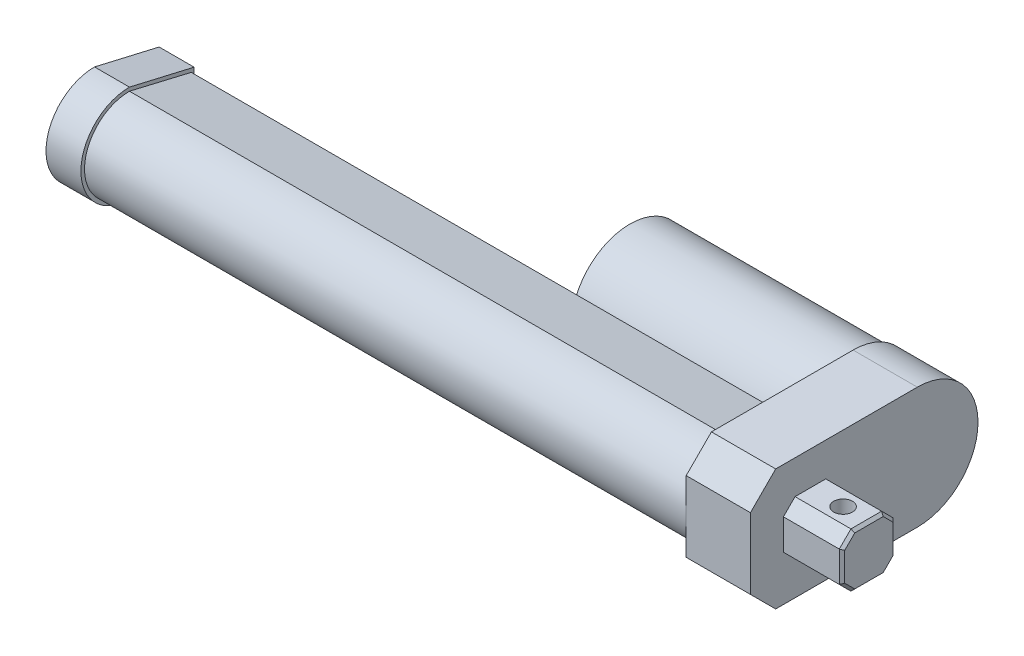
ISO-10303-21;
HEADER;
FILE_DESCRIPTION(('STEP AP214'),'2;1');
FILE_NAME('part.step','',(''),(''),'','','');
FILE_SCHEMA(('AUTOMOTIVE_DESIGN { 1 0 10303 214 1 1 1 1 }'));
ENDSEC;
DATA;
#1=APPLICATION_CONTEXT('core data for automotive mechanical design processes');
#2=APPLICATION_PROTOCOL_DEFINITION('international standard','automotive_design',2000,#1);
#3=PRODUCT_CONTEXT('',#1,'mechanical');
#4=PRODUCT('Part','Part','',(#3));
#5=PRODUCT_RELATED_PRODUCT_CATEGORY('part','',(#4));
#6=PRODUCT_DEFINITION_FORMATION('','',#4);
#7=PRODUCT_DEFINITION_CONTEXT('part definition',#1,'design');
#8=PRODUCT_DEFINITION('design','',#6,#7);
#9=PRODUCT_DEFINITION_SHAPE('','',#8);
#10=(LENGTH_UNIT() NAMED_UNIT(*) SI_UNIT(.MILLI.,.METRE.));
#11=(NAMED_UNIT(*) PLANE_ANGLE_UNIT() SI_UNIT($,.RADIAN.));
#12=(NAMED_UNIT(*) SI_UNIT($,.STERADIAN.) SOLID_ANGLE_UNIT());
#13=UNCERTAINTY_MEASURE_WITH_UNIT(LENGTH_MEASURE(1.E-05),#10,'distance_accuracy_value','');
#14=(GEOMETRIC_REPRESENTATION_CONTEXT(3) GLOBAL_UNCERTAINTY_ASSIGNED_CONTEXT((#13)) GLOBAL_UNIT_ASSIGNED_CONTEXT((#10,
#11,#12)) REPRESENTATION_CONTEXT('',''));
#15=CARTESIAN_POINT('',(0.,0.,0.));
#16=DIRECTION('',(0.,0.,1.));
#17=DIRECTION('',(1.,0.,0.));
#18=AXIS2_PLACEMENT_3D('',#15,#16,#17);
#19=CARTESIAN_POINT('',(0.,0.,0.));
#20=DIRECTION('',(1.,0.,0.));
#21=DIRECTION('',(0.,0.,-1.));
#22=AXIS2_PLACEMENT_3D('',#19,#20,#21);
#23=PLANE('',#22);
#24=CARTESIAN_POINT('',(0.,19.84375,-54.61));
#25=DIRECTION('',(1.,0.,0.));
#26=DIRECTION('',(0.,0.,-1.));
#27=AXIS2_PLACEMENT_3D('',#24,#25,#26);
#28=CIRCLE('',#27,19.05);
#29=CARTESIAN_POINT('',(0.,19.84375,-73.66));
#30=VERTEX_POINT('',#29);
#31=EDGE_CURVE('E309',#30,#30,#28,.F.);
#32=ORIENTED_EDGE('',*,*,#31,.F.);
#33=EDGE_LOOP('',(#32));
#34=FACE_BOUND('',#33,.T.);
#35=DIRECTION('',(0.,-0.229567479099,0.973292747604815));
#36=VECTOR('',#35,1.);
#37=CARTESIAN_POINT('',(0.,1.58042668071531,0.372770237819472));
#38=LINE('',#37,#36);
#39=CARTESIAN_POINT('',(0.,9.906,-34.925));
#40=VERTEX_POINT('',#39);
#41=CARTESIAN_POINT('',(0.,5.13714999999999,-14.7066));
#42=VERTEX_POINT('',#41);
#43=EDGE_CURVE('E250',#40,#42,#38,.T.);
#44=ORIENTED_EDGE('',*,*,#43,.F.);
#45=DIRECTION('',(0.,1.,0.));
#46=VECTOR('',#45,1.);
#47=CARTESIAN_POINT('',(0.,0.,-34.925));
#48=LINE('',#47,#46);
#49=CARTESIAN_POINT('',(0.,29.7815,-34.925));
#50=VERTEX_POINT('',#49);
#51=EDGE_CURVE('E265',#40,#50,#48,.T.);
#52=ORIENTED_EDGE('',*,*,#51,.T.);
#53=DIRECTION('',(0.,0.229567479099,0.973292747604815));
#54=VECTOR('',#53,1.);
#55=CARTESIAN_POINT('',(0.,36.0154933544711,-8.49486039862054));
#56=LINE('',#55,#54);
#57=CARTESIAN_POINT('',(0.,34.55035,-14.7066));
#58=VERTEX_POINT('',#57);
#59=EDGE_CURVE('E279',#50,#58,#56,.T.);
#60=ORIENTED_EDGE('',*,*,#59,.T.);
#61=CARTESIAN_POINT('',(0.,19.84375,-14.7066));
#62=DIRECTION('',(1.,0.,0.));
#63=DIRECTION('',(0.,0.,-1.));
#64=AXIS2_PLACEMENT_3D('',#61,#62,#63);
#65=CIRCLE('',#64,14.7066);
#66=CARTESIAN_POINT('',(0.,19.84375,0.));
#67=VERTEX_POINT('',#66);
#68=EDGE_CURVE('E308',#67,#58,#65,.F.);
#69=ORIENTED_EDGE('',*,*,#68,.F.);
#70=DIRECTION('',(0.,1.,0.));
#71=VECTOR('',#70,1.);
#72=CARTESIAN_POINT('',(0.,0.,0.));
#73=LINE('',#72,#71);
#74=CARTESIAN_POINT('',(0.,31.4256643774,0.));
#75=VERTEX_POINT('',#74);
#76=EDGE_CURVE('E339',#67,#75,#73,.T.);
#77=ORIENTED_EDGE('',*,*,#76,.T.);
#78=DIRECTION('',(0.,-0.707106781186548,0.707106781186547));
#79=VECTOR('',#78,1.);
#80=CARTESIAN_POINT('',(0.,31.4256643774,0.));
#81=LINE('',#80,#79);
#82=CARTESIAN_POINT('',(0.,39.6875,-8.26183562260002));
#83=VERTEX_POINT('',#82);
#84=EDGE_CURVE('E354',#75,#83,#81,.F.);
#85=ORIENTED_EDGE('',*,*,#84,.T.);
#86=DIRECTION('',(0.,0.,-1.));
#87=VECTOR('',#86,1.);
#88=CARTESIAN_POINT('',(0.,39.6875,0.));
#89=LINE('',#88,#87);
#90=CARTESIAN_POINT('',(0.,39.6875,-54.61));
#91=VERTEX_POINT('',#90);
#92=EDGE_CURVE('E336',#83,#91,#89,.T.);
#93=ORIENTED_EDGE('',*,*,#92,.T.);
#94=CARTESIAN_POINT('',(0.,19.84375,-54.61));
#95=DIRECTION('',(1.,0.,0.));
#96=DIRECTION('',(0.,0.,-1.));
#97=AXIS2_PLACEMENT_3D('',#94,#95,#96);
#98=CIRCLE('',#97,19.84375);
#99=CARTESIAN_POINT('',(0.,0.,-54.61));
#100=VERTEX_POINT('',#99);
#101=EDGE_CURVE('E332',#91,#100,#98,.F.);
#102=ORIENTED_EDGE('',*,*,#101,.T.);
#103=DIRECTION('',(0.,0.,-1.));
#104=VECTOR('',#103,1.);
#105=CARTESIAN_POINT('',(0.,0.,0.));
#106=LINE('',#105,#104);
#107=CARTESIAN_POINT('',(0.,0.,-8.26183562260002));
#108=VERTEX_POINT('',#107);
#109=EDGE_CURVE('E313',#108,#100,#106,.T.);
#110=ORIENTED_EDGE('',*,*,#109,.F.);
#111=DIRECTION('',(0.,0.707106781186548,0.707106781186548));
#112=VECTOR('',#111,1.);
#113=CARTESIAN_POINT('',(0.,0.,-8.26183562260002));
#114=LINE('',#113,#112);
#115=CARTESIAN_POINT('',(0.,8.26183562260002,0.));
#116=VERTEX_POINT('',#115);
#117=EDGE_CURVE('E357',#108,#116,#114,.T.);
#118=ORIENTED_EDGE('',*,*,#117,.T.);
#119=EDGE_CURVE('E318',#116,#67,#73,.T.);
#120=ORIENTED_EDGE('',*,*,#119,.T.);
#121=CARTESIAN_POINT('',(0.,19.84375,-14.7066));
#122=DIRECTION('',(-1.,0.,0.));
#123=DIRECTION('',(0.,0.,1.));
#124=AXIS2_PLACEMENT_3D('',#121,#122,#123);
#125=CIRCLE('',#124,14.7066);
#126=EDGE_CURVE('E255',#42,#67,#125,.T.);
#127=ORIENTED_EDGE('',*,*,#126,.F.);
#128=EDGE_LOOP('',(#44,#52,#60,#69,#77,#85,#93,#102,#110,#118,#120,#127));
#129=FACE_BOUND('',#128,.T.);
#130=ADVANCED_FACE('F42',(#34,#129),#23,.F.);
#131=CARTESIAN_POINT('',(21.0185,0.,0.));
#132=DIRECTION('',(0.,1.,0.));
#133=DIRECTION('',(0.,0.,1.));
#134=AXIS2_PLACEMENT_3D('',#131,#132,#133);
#135=PLANE('',#134);
#136=DIRECTION('',(0.,0.,-1.));
#137=VECTOR('',#136,1.);
#138=CARTESIAN_POINT('',(21.0185,0.,0.));
#139=LINE('',#138,#137);
#140=CARTESIAN_POINT('',(21.0185,0.,-8.26183562260002));
#141=VERTEX_POINT('',#140);
#142=CARTESIAN_POINT('',(21.0185,0.,-54.61));
#143=VERTEX_POINT('',#142);
#144=EDGE_CURVE('E314',#141,#143,#139,.T.);
#145=ORIENTED_EDGE('',*,*,#144,.F.);
#146=DIRECTION('',(-1.,0.,0.));
#147=VECTOR('',#146,1.);
#148=CARTESIAN_POINT('',(0.,0.,-8.26183562260002));
#149=LINE('',#148,#147);
#150=EDGE_CURVE('E350',#141,#108,#149,.T.);
#151=ORIENTED_EDGE('',*,*,#150,.T.);
#152=ORIENTED_EDGE('',*,*,#109,.T.);
#153=DIRECTION('',(-1.,0.,0.));
#154=VECTOR('',#153,1.);
#155=CARTESIAN_POINT('',(21.0185,0.,-54.61));
#156=LINE('',#155,#154);
#157=EDGE_CURVE('E346',#143,#100,#156,.T.);
#158=ORIENTED_EDGE('',*,*,#157,.F.);
#159=EDGE_LOOP('',(#145,#151,#152,#158));
#160=FACE_BOUND('',#159,.T.);
#161=ADVANCED_FACE('F568',(#160),#135,.F.);
#162=CARTESIAN_POINT('',(21.0185,19.84375,-54.61));
#163=DIRECTION('',(-1.,0.,0.));
#164=DIRECTION('',(0.,0.,1.));
#165=AXIS2_PLACEMENT_3D('',#162,#163,#164);
#166=CYLINDRICAL_SURFACE('',#165,19.84375);
#167=ORIENTED_EDGE('',*,*,#101,.F.);
#168=DIRECTION('',(-1.,0.,0.));
#169=VECTOR('',#168,1.);
#170=CARTESIAN_POINT('',(21.0185,39.6875,-54.61));
#171=LINE('',#170,#169);
#172=CARTESIAN_POINT('',(21.0185,39.6875,-54.61));
#173=VERTEX_POINT('',#172);
#174=EDGE_CURVE('E329',#173,#91,#171,.T.);
#175=ORIENTED_EDGE('',*,*,#174,.F.);
#176=CARTESIAN_POINT('',(21.0185,19.84375,-54.61));
#177=DIRECTION('',(1.,0.,0.));
#178=DIRECTION('',(0.,0.,-1.));
#179=AXIS2_PLACEMENT_3D('',#176,#177,#178);
#180=CIRCLE('',#179,19.84375);
#181=EDGE_CURVE('E317',#173,#143,#180,.F.);
#182=ORIENTED_EDGE('',*,*,#181,.T.);
#183=ORIENTED_EDGE('',*,*,#157,.T.);
#184=EDGE_LOOP('',(#167,#175,#182,#183));
#185=FACE_BOUND('',#184,.T.);
#186=ADVANCED_FACE('F574',(#185),#166,.T.);
#187=CARTESIAN_POINT('',(21.0185,39.6875,0.));
#188=DIRECTION('',(0.,1.,0.));
#189=DIRECTION('',(0.,0.,1.));
#190=AXIS2_PLACEMENT_3D('',#187,#188,#189);
#191=PLANE('',#190);
#192=ORIENTED_EDGE('',*,*,#92,.F.);
#193=DIRECTION('',(1.,0.,0.));
#194=VECTOR('',#193,1.);
#195=CARTESIAN_POINT('',(21.0185,39.6875,-8.26183562260002));
#196=LINE('',#195,#194);
#197=CARTESIAN_POINT('',(21.0185,39.6875,-8.26183562260002));
#198=VERTEX_POINT('',#197);
#199=EDGE_CURVE('E373',#83,#198,#196,.T.);
#200=ORIENTED_EDGE('',*,*,#199,.T.);
#201=DIRECTION('',(0.,0.,-1.));
#202=VECTOR('',#201,1.);
#203=CARTESIAN_POINT('',(21.0185,39.6875,0.));
#204=LINE('',#203,#202);
#205=EDGE_CURVE('E322',#198,#173,#204,.T.);
#206=ORIENTED_EDGE('',*,*,#205,.T.);
#207=ORIENTED_EDGE('',*,*,#174,.T.);
#208=EDGE_LOOP('',(#192,#200,#206,#207));
#209=FACE_BOUND('',#208,.T.);
#210=ADVANCED_FACE('F586',(#209),#191,.T.);
#211=CARTESIAN_POINT('',(21.0185,0.,0.));
#212=DIRECTION('',(0.,0.,1.));
#213=DIRECTION('',(1.,0.,0.));
#214=AXIS2_PLACEMENT_3D('',#211,#212,#213);
#215=PLANE('',#214);
#216=ORIENTED_EDGE('',*,*,#119,.F.);
#217=DIRECTION('',(1.,0.,0.));
#218=VECTOR('',#217,1.);
#219=CARTESIAN_POINT('',(21.0185,8.26183562260002,0.));
#220=LINE('',#219,#218);
#221=CARTESIAN_POINT('',(21.0185,8.26183562260002,0.));
#222=VERTEX_POINT('',#221);
#223=EDGE_CURVE('E364',#116,#222,#220,.T.);
#224=ORIENTED_EDGE('',*,*,#223,.T.);
#225=DIRECTION('',(0.,1.,0.));
#226=VECTOR('',#225,1.);
#227=CARTESIAN_POINT('',(21.0185,0.,0.));
#228=LINE('',#227,#226);
#229=CARTESIAN_POINT('',(21.0185,31.4256643774,0.));
#230=VERTEX_POINT('',#229);
#231=EDGE_CURVE('E325',#222,#230,#228,.T.);
#232=ORIENTED_EDGE('',*,*,#231,.T.);
#233=DIRECTION('',(-1.,0.,0.));
#234=VECTOR('',#233,1.);
#235=CARTESIAN_POINT('',(21.0185,31.4256643774,0.));
#236=LINE('',#235,#234);
#237=EDGE_CURVE('E360',#230,#75,#236,.T.);
#238=ORIENTED_EDGE('',*,*,#237,.T.);
#239=ORIENTED_EDGE('',*,*,#76,.F.);
#240=EDGE_LOOP('',(#216,#224,#232,#238,#239));
#241=FACE_BOUND('',#240,.T.);
#242=ADVANCED_FACE('F583',(#241),#215,.T.);
#243=CARTESIAN_POINT('',(21.0185,0.,0.));
#244=DIRECTION('',(1.,0.,0.));
#245=DIRECTION('',(0.,0.,-1.));
#246=AXIS2_PLACEMENT_3D('',#243,#244,#245);
#247=PLANE('',#246);
#248=DIRECTION('',(0.,1.,0.));
#249=VECTOR('',#248,1.);
#250=CARTESIAN_POINT('',(21.0185,0.,-28.4480000000004));
#251=LINE('',#250,#249);
#252=CARTESIAN_POINT('',(21.0185,14.82725,-28.4480000000004));
#253=VERTEX_POINT('',#252);
#254=CARTESIAN_POINT('',(21.0185,24.8602499999999,-28.4480000000004));
#255=VERTEX_POINT('',#254);
#256=EDGE_CURVE('E512',#253,#255,#251,.T.);
#257=ORIENTED_EDGE('',*,*,#256,.F.);
#258=DIRECTION('',(0.,-0.707106781186545,0.70710678118655));
#259=VECTOR('',#258,1.);
#260=CARTESIAN_POINT('',(21.0185,14.82725,-28.4480000000004));
#261=LINE('',#260,#259);
#262=CARTESIAN_POINT('',(21.0185,11.01725,-24.6380000000004));
#263=VERTEX_POINT('',#262);
#264=EDGE_CURVE('E413',#253,#263,#261,.T.);
#265=ORIENTED_EDGE('',*,*,#264,.T.);
#266=DIRECTION('',(0.,0.,1.));
#267=VECTOR('',#266,1.);
#268=CARTESIAN_POINT('',(21.0185,11.01725,0.));
#269=LINE('',#268,#267);
#270=CARTESIAN_POINT('',(21.0185,11.01725,-14.605));
#271=VERTEX_POINT('',#270);
#272=EDGE_CURVE('E506',#263,#271,#269,.T.);
#273=ORIENTED_EDGE('',*,*,#272,.T.);
#274=DIRECTION('',(0.,0.707106781186548,0.707106781186548));
#275=VECTOR('',#274,1.);
#276=CARTESIAN_POINT('',(21.0185,11.01725,-14.605));
#277=LINE('',#276,#275);
#278=CARTESIAN_POINT('',(21.0185,14.82725,-10.795));
#279=VERTEX_POINT('',#278);
#280=EDGE_CURVE('E416',#271,#279,#277,.T.);
#281=ORIENTED_EDGE('',*,*,#280,.T.);
#282=DIRECTION('',(0.,-1.,0.));
#283=VECTOR('',#282,1.);
#284=CARTESIAN_POINT('',(21.0185,0.,-10.795));
#285=LINE('',#284,#283);
#286=CARTESIAN_POINT('',(21.0185,24.86025,-10.795));
#287=VERTEX_POINT('',#286);
#288=EDGE_CURVE('E520',#287,#279,#285,.T.);
#289=ORIENTED_EDGE('',*,*,#288,.F.);
#290=DIRECTION('',(0.,-0.707106781186548,0.707106781186548));
#291=VECTOR('',#290,1.);
#292=CARTESIAN_POINT('',(21.0185,24.86025,-10.795));
#293=LINE('',#292,#291);
#294=CARTESIAN_POINT('',(21.0185,28.67025,-14.605));
#295=VERTEX_POINT('',#294);
#296=EDGE_CURVE('E407',#287,#295,#293,.F.);
#297=ORIENTED_EDGE('',*,*,#296,.T.);
#298=DIRECTION('',(0.,0.,1.));
#299=VECTOR('',#298,1.);
#300=CARTESIAN_POINT('',(21.0185,28.67025,0.));
#301=LINE('',#300,#299);
#302=CARTESIAN_POINT('',(21.0185,28.67025,-24.6380000000004));
#303=VERTEX_POINT('',#302);
#304=EDGE_CURVE('E516',#303,#295,#301,.T.);
#305=ORIENTED_EDGE('',*,*,#304,.F.);
#306=DIRECTION('',(0.,0.707106781186548,0.707106781186548));
#307=VECTOR('',#306,1.);
#308=CARTESIAN_POINT('',(21.0185,28.67025,-24.6380000000004));
#309=LINE('',#308,#307);
#310=EDGE_CURVE('E410',#303,#255,#309,.F.);
#311=ORIENTED_EDGE('',*,*,#310,.T.);
#312=EDGE_LOOP('',(#257,#265,#273,#281,#289,#297,#305,#311));
#313=FACE_BOUND('',#312,.T.);
#314=ORIENTED_EDGE('',*,*,#231,.F.);
#315=DIRECTION('',(0.,-0.707106781186548,-0.707106781186548));
#316=VECTOR('',#315,1.);
#317=CARTESIAN_POINT('',(21.0185,4.13091781130001,-4.13091781130001));
#318=LINE('',#317,#316);
#319=EDGE_CURVE('E370',#222,#141,#318,.T.);
#320=ORIENTED_EDGE('',*,*,#319,.T.);
#321=ORIENTED_EDGE('',*,*,#144,.T.);
#322=ORIENTED_EDGE('',*,*,#181,.F.);
#323=ORIENTED_EDGE('',*,*,#205,.F.);
#324=DIRECTION('',(0.,0.707106781186548,-0.707106781186547));
#325=VECTOR('',#324,1.);
#326=CARTESIAN_POINT('',(21.0185,15.7128321887,15.7128321887));
#327=LINE('',#326,#325);
#328=EDGE_CURVE('E367',#198,#230,#327,.F.);
#329=ORIENTED_EDGE('',*,*,#328,.T.);
#330=EDGE_LOOP('',(#314,#320,#321,#322,#323,#329));
#331=FACE_BOUND('',#330,.T.);
#332=ADVANCED_FACE('F581',(#313,#331),#247,.T.);
#333=CARTESIAN_POINT('',(21.0185,0.,-8.26183562260002));
#334=DIRECTION('',(0.,-0.707106781186547,0.707106781186547));
#335=DIRECTION('',(1.,0.,0.));
#336=AXIS2_PLACEMENT_3D('',#333,#334,#335);
#337=PLANE('',#336);
#338=ORIENTED_EDGE('',*,*,#319,.F.);
#339=ORIENTED_EDGE('',*,*,#223,.F.);
#340=ORIENTED_EDGE('',*,*,#117,.F.);
#341=ORIENTED_EDGE('',*,*,#150,.F.);
#342=EDGE_LOOP('',(#338,#339,#340,#341));
#343=FACE_BOUND('',#342,.T.);
#344=ADVANCED_FACE('F594',(#343),#337,.T.);
#345=CARTESIAN_POINT('',(21.0185,31.4256643774,0.));
#346=DIRECTION('',(0.,-0.707106781186547,-0.707106781186548));
#347=DIRECTION('',(-1.,0.,0.));
#348=AXIS2_PLACEMENT_3D('',#345,#346,#347);
#349=PLANE('',#348);
#350=ORIENTED_EDGE('',*,*,#328,.F.);
#351=ORIENTED_EDGE('',*,*,#199,.F.);
#352=ORIENTED_EDGE('',*,*,#84,.F.);
#353=ORIENTED_EDGE('',*,*,#237,.F.);
#354=EDGE_LOOP('',(#350,#351,#352,#353));
#355=FACE_BOUND('',#354,.T.);
#356=ADVANCED_FACE('F597',(#355),#349,.F.);
#357=CARTESIAN_POINT('',(-73.025,19.84375,-54.61));
#358=DIRECTION('',(1.,0.,0.));
#359=DIRECTION('',(0.,0.,-1.));
#360=AXIS2_PLACEMENT_3D('',#357,#358,#359);
#361=CYLINDRICAL_SURFACE('',#360,19.05);
#362=CARTESIAN_POINT('',(-73.025,19.84375,-54.61));
#363=DIRECTION('',(-1.,0.,0.));
#364=DIRECTION('',(0.,0.,1.));
#365=AXIS2_PLACEMENT_3D('',#362,#363,#364);
#366=CIRCLE('',#365,19.05);
#367=CARTESIAN_POINT('',(-73.025,19.84375,-35.56));
#368=VERTEX_POINT('',#367);
#369=EDGE_CURVE('E303',#368,#368,#366,.T.);
#370=ORIENTED_EDGE('',*,*,#369,.F.);
#371=EDGE_LOOP('',(#370));
#372=FACE_BOUND('',#371,.T.);
#373=ORIENTED_EDGE('',*,*,#31,.T.);
#374=EDGE_LOOP('',(#373));
#375=FACE_BOUND('',#374,.T.);
#376=ADVANCED_FACE('F601',(#372,#375),#361,.T.);
#377=CARTESIAN_POINT('',(-73.025,19.84375,-54.61));
#378=DIRECTION('',(-1.,0.,0.));
#379=DIRECTION('',(0.,0.,1.));
#380=AXIS2_PLACEMENT_3D('',#377,#378,#379);
#381=PLANE('',#380);
#382=CARTESIAN_POINT('',(-73.025,19.84375,-54.61));
#383=DIRECTION('',(-1.,0.,0.));
#384=DIRECTION('',(0.,0.,1.));
#385=AXIS2_PLACEMENT_3D('',#382,#383,#384);
#386=CIRCLE('',#385,6.35);
#387=CARTESIAN_POINT('',(-73.025,19.84375,-48.26));
#388=VERTEX_POINT('',#387);
#389=EDGE_CURVE('E304',#388,#388,#386,.T.);
#390=ORIENTED_EDGE('',*,*,#389,.F.);
#391=EDGE_LOOP('',(#390));
#392=FACE_BOUND('',#391,.T.);
#393=ORIENTED_EDGE('',*,*,#369,.T.);
#394=EDGE_LOOP('',(#393));
#395=FACE_BOUND('',#394,.T.);
#396=ADVANCED_FACE('F748',(#392,#395),#381,.T.);
#397=CARTESIAN_POINT('',(-75.565,19.84375,-54.61));
#398=DIRECTION('',(1.,0.,0.));
#399=DIRECTION('',(0.,0.,-1.));
#400=AXIS2_PLACEMENT_3D('',#397,#398,#399);
#401=CYLINDRICAL_SURFACE('',#400,6.35);
#402=CARTESIAN_POINT('',(-75.565,19.84375,-54.61));
#403=DIRECTION('',(-1.,0.,0.));
#404=DIRECTION('',(0.,0.,1.));
#405=AXIS2_PLACEMENT_3D('',#402,#403,#404);
#406=CIRCLE('',#405,6.35);
#407=CARTESIAN_POINT('',(-75.565,19.84375,-48.26));
#408=VERTEX_POINT('',#407);
#409=EDGE_CURVE('E299',#408,#408,#406,.T.);
#410=ORIENTED_EDGE('',*,*,#409,.F.);
#411=EDGE_LOOP('',(#410));
#412=FACE_BOUND('',#411,.T.);
#413=ORIENTED_EDGE('',*,*,#389,.T.);
#414=EDGE_LOOP('',(#413));
#415=FACE_BOUND('',#414,.T.);
#416=ADVANCED_FACE('F744',(#412,#415),#401,.T.);
#417=CARTESIAN_POINT('',(-75.565,19.84375,-54.61));
#418=DIRECTION('',(-1.,0.,0.));
#419=DIRECTION('',(0.,0.,1.));
#420=AXIS2_PLACEMENT_3D('',#417,#418,#419);
#421=PLANE('',#420);
#422=ORIENTED_EDGE('',*,*,#409,.T.);
#423=EDGE_LOOP('',(#422));
#424=FACE_BOUND('',#423,.T.);
#425=ADVANCED_FACE('F740',(#424),#421,.T.);
#426=CARTESIAN_POINT('',(-196.85,1.58042668071531,0.372770237819472));
#427=DIRECTION('',(0.,0.973292747604815,0.229567479099));
#428=DIRECTION('',(0.,-0.229567479099,0.973292747604815));
#429=AXIS2_PLACEMENT_3D('',#426,#427,#428);
#430=PLANE('',#429);
#431=ORIENTED_EDGE('',*,*,#43,.T.);
#432=DIRECTION('',(1.,0.,0.));
#433=VECTOR('',#432,1.);
#434=CARTESIAN_POINT('',(-196.85,5.13714999999999,-14.7066));
#435=LINE('',#434,#433);
#436=CARTESIAN_POINT('',(-196.85,5.13714999999999,-14.7066));
#437=VERTEX_POINT('',#436);
#438=EDGE_CURVE('E296',#437,#42,#435,.T.);
#439=ORIENTED_EDGE('',*,*,#438,.F.);
#440=DIRECTION('',(0.,-0.229567479099,0.973292747604815));
#441=VECTOR('',#440,1.);
#442=CARTESIAN_POINT('',(-196.85,1.58042668071531,0.372770237819472));
#443=LINE('',#442,#441);
#444=CARTESIAN_POINT('',(-196.85,9.906,-34.925));
#445=VERTEX_POINT('',#444);
#446=EDGE_CURVE('E261',#445,#437,#443,.T.);
#447=ORIENTED_EDGE('',*,*,#446,.F.);
#448=DIRECTION('',(1.,0.,0.));
#449=VECTOR('',#448,1.);
#450=CARTESIAN_POINT('',(-196.85,9.906,-34.925));
#451=LINE('',#450,#449);
#452=EDGE_CURVE('E275',#445,#40,#451,.T.);
#453=ORIENTED_EDGE('',*,*,#452,.T.);
#454=EDGE_LOOP('',(#431,#439,#447,#453));
#455=FACE_BOUND('',#454,.T.);
#456=ADVANCED_FACE('F736',(#455),#430,.F.);
#457=CARTESIAN_POINT('',(-196.85,19.84375,-14.7066));
#458=DIRECTION('',(1.,0.,0.));
#459=DIRECTION('',(0.,0.,-1.));
#460=AXIS2_PLACEMENT_3D('',#457,#458,#459);
#461=CYLINDRICAL_SURFACE('',#460,14.7066);
#462=ORIENTED_EDGE('',*,*,#126,.T.);
#463=ORIENTED_EDGE('',*,*,#68,.T.);
#464=DIRECTION('',(1.,0.,0.));
#465=VECTOR('',#464,1.);
#466=CARTESIAN_POINT('',(-196.85,34.55035,-14.7066));
#467=LINE('',#466,#465);
#468=CARTESIAN_POINT('',(-196.85,34.55035,-14.7066));
#469=VERTEX_POINT('',#468);
#470=EDGE_CURVE('E292',#469,#58,#467,.T.);
#471=ORIENTED_EDGE('',*,*,#470,.F.);
#472=CARTESIAN_POINT('',(-196.85,19.84375,-14.7066));
#473=DIRECTION('',(-1.,0.,0.));
#474=DIRECTION('',(0.,0.,1.));
#475=AXIS2_PLACEMENT_3D('',#472,#473,#474);
#476=CIRCLE('',#475,14.7066);
#477=EDGE_CURVE('E264',#437,#469,#476,.T.);
#478=ORIENTED_EDGE('',*,*,#477,.F.);
#479=ORIENTED_EDGE('',*,*,#438,.T.);
#480=EDGE_LOOP('',(#462,#463,#471,#478,#479));
#481=FACE_BOUND('',#480,.T.);
#482=ADVANCED_FACE('F729',(#481),#461,.T.);
#483=CARTESIAN_POINT('',(-196.85,36.0154933544711,-8.49486039862054));
#484=DIRECTION('',(0.,0.973292747604815,-0.229567479099));
#485=DIRECTION('',(0.,0.229567479099,0.973292747604815));
#486=AXIS2_PLACEMENT_3D('',#483,#484,#485);
#487=PLANE('',#486);
#488=ORIENTED_EDGE('',*,*,#59,.F.);
#489=DIRECTION('',(1.,0.,0.));
#490=VECTOR('',#489,1.);
#491=CARTESIAN_POINT('',(-196.85,29.7815,-34.925));
#492=LINE('',#491,#490);
#493=CARTESIAN_POINT('',(-196.85,29.7815,-34.925));
#494=VERTEX_POINT('',#493);
#495=EDGE_CURVE('E288',#494,#50,#492,.T.);
#496=ORIENTED_EDGE('',*,*,#495,.F.);
#497=DIRECTION('',(0.,0.229567479099,0.973292747604815));
#498=VECTOR('',#497,1.);
#499=CARTESIAN_POINT('',(-196.85,36.0154933544711,-8.49486039862054));
#500=LINE('',#499,#498);
#501=EDGE_CURVE('E268',#494,#469,#500,.T.);
#502=ORIENTED_EDGE('',*,*,#501,.T.);
#503=ORIENTED_EDGE('',*,*,#470,.T.);
#504=EDGE_LOOP('',(#488,#496,#502,#503));
#505=FACE_BOUND('',#504,.T.);
#506=ADVANCED_FACE('F723',(#505),#487,.T.);
#507=CARTESIAN_POINT('',(-196.85,0.,-34.925));
#508=DIRECTION('',(0.,0.,-1.));
#509=DIRECTION('',(-1.,0.,0.));
#510=AXIS2_PLACEMENT_3D('',#507,#508,#509);
#511=PLANE('',#510);
#512=ORIENTED_EDGE('',*,*,#51,.F.);
#513=ORIENTED_EDGE('',*,*,#452,.F.);
#514=DIRECTION('',(0.,1.,0.));
#515=VECTOR('',#514,1.);
#516=CARTESIAN_POINT('',(-196.85,0.,-34.925));
#517=LINE('',#516,#515);
#518=EDGE_CURVE('E272',#445,#494,#517,.T.);
#519=ORIENTED_EDGE('',*,*,#518,.T.);
#520=ORIENTED_EDGE('',*,*,#495,.T.);
#521=EDGE_LOOP('',(#512,#513,#519,#520));
#522=FACE_BOUND('',#521,.T.);
#523=ADVANCED_FACE('F717',(#522),#511,.T.);
#524=CARTESIAN_POINT('',(-196.85,0.,0.));
#525=DIRECTION('',(-1.,0.,0.));
#526=DIRECTION('',(0.,0.,1.));
#527=AXIS2_PLACEMENT_3D('',#524,#525,#526);
#528=PLANE('',#527);
#529=DIRECTION('',(0.,-1.,0.));
#530=VECTOR('',#529,1.);
#531=CARTESIAN_POINT('',(-196.85,0.,-35.8523924341883));
#532=LINE('',#531,#530);
#533=CARTESIAN_POINT('',(-196.85,30.7975,-35.8523924341883));
#534=VERTEX_POINT('',#533);
#535=CARTESIAN_POINT('',(-196.85,8.89,-35.8523924341883));
#536=VERTEX_POINT('',#535);
#537=EDGE_CURVE('E248',#534,#536,#532,.T.);
#538=ORIENTED_EDGE('',*,*,#537,.F.);
#539=DIRECTION('',(0.,-0.226659064085117,-0.973974162217899));
#540=VECTOR('',#539,1.);
#541=CARTESIAN_POINT('',(-196.85,37.1300757677908,-8.64075100695962));
#542=LINE('',#541,#540);
#543=CARTESIAN_POINT('',(-196.85,35.7184575658117,-14.7066));
#544=VERTEX_POINT('',#543);
#545=EDGE_CURVE('E244',#544,#534,#542,.T.);
#546=ORIENTED_EDGE('',*,*,#545,.F.);
#547=CARTESIAN_POINT('',(-196.85,19.84375,-14.7066));
#548=DIRECTION('',(-1.,0.,0.));
#549=DIRECTION('',(0.,0.,1.));
#550=AXIS2_PLACEMENT_3D('',#547,#548,#549);
#551=CIRCLE('',#550,15.8747075658117);
#552=CARTESIAN_POINT('',(-196.85,3.9690424341883,-14.7066));
#553=VERTEX_POINT('',#552);
#554=EDGE_CURVE('E542',#544,#553,#551,.F.);
#555=ORIENTED_EDGE('',*,*,#554,.T.);
#556=DIRECTION('',(0.,-0.226659064085117,0.973974162217899));
#557=VECTOR('',#556,1.);
#558=CARTESIAN_POINT('',(-196.85,0.518505457472728,0.120664352580127));
#559=LINE('',#558,#557);
#560=EDGE_CURVE('E539',#536,#553,#559,.T.);
#561=ORIENTED_EDGE('',*,*,#560,.F.);
#562=EDGE_LOOP('',(#538,#546,#555,#561));
#563=FACE_BOUND('',#562,.T.);
#564=ORIENTED_EDGE('',*,*,#518,.F.);
#565=ORIENTED_EDGE('',*,*,#446,.T.);
#566=ORIENTED_EDGE('',*,*,#477,.T.);
#567=ORIENTED_EDGE('',*,*,#501,.F.);
#568=EDGE_LOOP('',(#564,#565,#566,#567));
#569=FACE_BOUND('',#568,.T.);
#570=ADVANCED_FACE('F556',(#563,#569),#528,.F.);
#571=CARTESIAN_POINT('',(-208.28,0.,-35.8523924341883));
#572=DIRECTION('',(0.,0.,1.));
#573=DIRECTION('',(1.,0.,0.));
#574=AXIS2_PLACEMENT_3D('',#571,#572,#573);
#575=PLANE('',#574);
#576=ORIENTED_EDGE('',*,*,#537,.T.);
#577=DIRECTION('',(1.,0.,0.));
#578=VECTOR('',#577,1.);
#579=CARTESIAN_POINT('',(-208.28,8.89,-35.8523924341883));
#580=LINE('',#579,#578);
#581=CARTESIAN_POINT('',(-208.28,8.89,-35.8523924341883));
#582=VERTEX_POINT('',#581);
#583=EDGE_CURVE('E226',#582,#536,#580,.T.);
#584=ORIENTED_EDGE('',*,*,#583,.F.);
#585=DIRECTION('',(0.,-1.,0.));
#586=VECTOR('',#585,1.);
#587=CARTESIAN_POINT('',(-208.28,0.,-35.8523924341883));
#588=LINE('',#587,#586);
#589=CARTESIAN_POINT('',(-208.28,30.7975,-35.8523924341883));
#590=VERTEX_POINT('',#589);
#591=EDGE_CURVE('E234',#590,#582,#588,.T.);
#592=ORIENTED_EDGE('',*,*,#591,.F.);
#593=DIRECTION('',(1.,0.,0.));
#594=VECTOR('',#593,1.);
#595=CARTESIAN_POINT('',(-208.28,30.7975,-35.8523924341883));
#596=LINE('',#595,#594);
#597=EDGE_CURVE('E536',#590,#534,#596,.T.);
#598=ORIENTED_EDGE('',*,*,#597,.T.);
#599=EDGE_LOOP('',(#576,#584,#592,#598));
#600=FACE_BOUND('',#599,.T.);
#601=ADVANCED_FACE('F246',(#600),#575,.F.);
#602=CARTESIAN_POINT('',(-208.28,0.518505457472728,0.120664352580127));
#603=DIRECTION('',(0.,0.973974162217899,0.226659064085117));
#604=DIRECTION('',(0.,-0.226659064085117,0.973974162217899));
#605=AXIS2_PLACEMENT_3D('',#602,#603,#604);
#606=PLANE('',#605);
#607=ORIENTED_EDGE('',*,*,#560,.T.);
#608=DIRECTION('',(1.,0.,0.));
#609=VECTOR('',#608,1.);
#610=CARTESIAN_POINT('',(-208.28,3.9690424341883,-14.7066));
#611=LINE('',#610,#609);
#612=CARTESIAN_POINT('',(-208.28,3.9690424341883,-14.7066));
#613=VERTEX_POINT('',#612);
#614=EDGE_CURVE('E228',#613,#553,#611,.T.);
#615=ORIENTED_EDGE('',*,*,#614,.F.);
#616=DIRECTION('',(0.,-0.226659064085117,0.973974162217899));
#617=VECTOR('',#616,1.);
#618=CARTESIAN_POINT('',(-208.28,0.518505457472728,0.120664352580127));
#619=LINE('',#618,#617);
#620=EDGE_CURVE('E221',#582,#613,#619,.T.);
#621=ORIENTED_EDGE('',*,*,#620,.F.);
#622=ORIENTED_EDGE('',*,*,#583,.T.);
#623=EDGE_LOOP('',(#607,#615,#621,#622));
#624=FACE_BOUND('',#623,.T.);
#625=ADVANCED_FACE('F224',(#624),#606,.F.);
#626=CARTESIAN_POINT('',(-208.28,19.84375,-14.7066));
#627=DIRECTION('',(1.,0.,0.));
#628=DIRECTION('',(0.,0.,-1.));
#629=AXIS2_PLACEMENT_3D('',#626,#627,#628);
#630=CYLINDRICAL_SURFACE('',#629,15.8747075658117);
#631=ORIENTED_EDGE('',*,*,#554,.F.);
#632=DIRECTION('',(1.,0.,0.));
#633=VECTOR('',#632,1.);
#634=CARTESIAN_POINT('',(-208.28,35.7184575658117,-14.7066));
#635=LINE('',#634,#633);
#636=CARTESIAN_POINT('',(-208.28,35.7184575658117,-14.7066));
#637=VERTEX_POINT('',#636);
#638=EDGE_CURVE('E257',#637,#544,#635,.T.);
#639=ORIENTED_EDGE('',*,*,#638,.F.);
#640=CARTESIAN_POINT('',(-208.28,19.84375,-14.7066));
#641=DIRECTION('',(-1.,0.,0.));
#642=DIRECTION('',(0.,0.,1.));
#643=AXIS2_PLACEMENT_3D('',#640,#641,#642);
#644=CIRCLE('',#643,15.8747075658117);
#645=EDGE_CURVE('E233',#637,#613,#644,.F.);
#646=ORIENTED_EDGE('',*,*,#645,.T.);
#647=ORIENTED_EDGE('',*,*,#614,.T.);
#648=EDGE_LOOP('',(#631,#639,#646,#647));
#649=FACE_BOUND('',#648,.T.);
#650=ADVANCED_FACE('F558',(#649),#630,.T.);
#651=CARTESIAN_POINT('',(-208.28,37.1300757677908,-8.64075100695962));
#652=DIRECTION('',(0.,-0.973974162217899,0.226659064085117));
#653=DIRECTION('',(0.,-0.226659064085117,-0.973974162217899));
#654=AXIS2_PLACEMENT_3D('',#651,#652,#653);
#655=PLANE('',#654);
#656=ORIENTED_EDGE('',*,*,#545,.T.);
#657=ORIENTED_EDGE('',*,*,#597,.F.);
#658=DIRECTION('',(0.,-0.226659064085117,-0.973974162217899));
#659=VECTOR('',#658,1.);
#660=CARTESIAN_POINT('',(-208.28,37.1300757677908,-8.64075100695962));
#661=LINE('',#660,#659);
#662=EDGE_CURVE('E239',#637,#590,#661,.T.);
#663=ORIENTED_EDGE('',*,*,#662,.F.);
#664=ORIENTED_EDGE('',*,*,#638,.T.);
#665=EDGE_LOOP('',(#656,#657,#663,#664));
#666=FACE_BOUND('',#665,.T.);
#667=ADVANCED_FACE('F552',(#666),#655,.F.);
#668=CARTESIAN_POINT('',(-208.28,0.,0.));
#669=DIRECTION('',(-1.,0.,0.));
#670=DIRECTION('',(0.,0.,1.));
#671=AXIS2_PLACEMENT_3D('',#668,#669,#670);
#672=PLANE('',#671);
#673=CARTESIAN_POINT('',(-208.28,19.84375,-14.7066));
#674=DIRECTION('',(-1.,0.,0.));
#675=DIRECTION('',(0.,0.,1.));
#676=AXIS2_PLACEMENT_3D('',#673,#674,#675);
#677=CIRCLE('',#676,10.00125);
#678=CARTESIAN_POINT('',(-208.28,19.84375,-4.70535));
#679=VERTEX_POINT('',#678);
#680=EDGE_CURVE('E524',#679,#679,#677,.T.);
#681=ORIENTED_EDGE('',*,*,#680,.F.);
#682=EDGE_LOOP('',(#681));
#683=FACE_BOUND('',#682,.T.);
#684=ORIENTED_EDGE('',*,*,#591,.T.);
#685=ORIENTED_EDGE('',*,*,#620,.T.);
#686=ORIENTED_EDGE('',*,*,#645,.F.);
#687=ORIENTED_EDGE('',*,*,#662,.T.);
#688=EDGE_LOOP('',(#684,#685,#686,#687));
#689=FACE_BOUND('',#688,.T.);
#690=ADVANCED_FACE('F237',(#683,#689),#672,.T.);
#691=CARTESIAN_POINT('',(-5.08,19.84375,-14.7066));
#692=DIRECTION('',(-1.,0.,0.));
#693=DIRECTION('',(0.,0.,1.));
#694=AXIS2_PLACEMENT_3D('',#691,#692,#693);
#695=CYLINDRICAL_SURFACE('',#694,10.00125);
#696=CARTESIAN_POINT('',(-5.08,19.84375,-14.7066));
#697=DIRECTION('',(-1.,0.,0.));
#698=DIRECTION('',(0.,0.,1.));
#699=AXIS2_PLACEMENT_3D('',#696,#697,#698);
#700=CIRCLE('',#699,10.00125);
#701=CARTESIAN_POINT('',(-5.08,19.84375,-4.70535));
#702=VERTEX_POINT('',#701);
#703=EDGE_CURVE('E525',#702,#702,#700,.T.);
#704=ORIENTED_EDGE('',*,*,#703,.F.);
#705=EDGE_LOOP('',(#704));
#706=FACE_BOUND('',#705,.T.);
#707=ORIENTED_EDGE('',*,*,#680,.T.);
#708=EDGE_LOOP('',(#707));
#709=FACE_BOUND('',#708,.T.);
#710=ADVANCED_FACE('F708',(#706,#709),#695,.F.);
#711=CARTESIAN_POINT('',(-5.08,19.84375,-14.7066));
#712=DIRECTION('',(-1.,0.,0.));
#713=DIRECTION('',(0.,0.,1.));
#714=AXIS2_PLACEMENT_3D('',#711,#712,#713);
#715=PLANE('',#714);
#716=ORIENTED_EDGE('',*,*,#703,.T.);
#717=EDGE_LOOP('',(#716));
#718=FACE_BOUND('',#717,.T.);
#719=ADVANCED_FACE('F701',(#718),#715,.T.);
#720=CARTESIAN_POINT('',(40.1828,11.01725,0.));
#721=DIRECTION('',(0.,-1.,0.));
#722=DIRECTION('',(0.,0.,-1.));
#723=AXIS2_PLACEMENT_3D('',#720,#721,#722);
#724=PLANE('',#723);
#725=CARTESIAN_POINT('',(31.7119,11.01725,-19.6215000000002));
#726=DIRECTION('',(0.,-1.,0.));
#727=DIRECTION('',(0.,0.,-1.));
#728=AXIS2_PLACEMENT_3D('',#725,#726,#727);
#729=CIRCLE('',#728,3.0734);
#730=CARTESIAN_POINT('',(31.7119,11.01725,-22.6949000000002));
#731=VERTEX_POINT('',#730);
#732=EDGE_CURVE('E493',#731,#731,#729,.T.);
#733=ORIENTED_EDGE('',*,*,#732,.F.);
#734=EDGE_LOOP('',(#733));
#735=FACE_BOUND('',#734,.T.);
#736=DIRECTION('',(1.,0.,0.));
#737=VECTOR('',#736,1.);
#738=CARTESIAN_POINT('',(40.1828,11.01725,-24.6380000000004));
#739=LINE('',#738,#737);
#740=CARTESIAN_POINT('',(39.2938,11.01725,-24.6380000000004));
#741=VERTEX_POINT('',#740);
#742=EDGE_CURVE('E404',#263,#741,#739,.T.);
#743=ORIENTED_EDGE('',*,*,#742,.T.);
#744=DIRECTION('',(0.,0.,1.));
#745=VECTOR('',#744,1.);
#746=CARTESIAN_POINT('',(39.2938,11.01725,0.));
#747=LINE('',#746,#745);
#748=CARTESIAN_POINT('',(39.2938,11.01725,-14.605));
#749=VERTEX_POINT('',#748);
#750=EDGE_CURVE('E11',#741,#749,#747,.T.);
#751=ORIENTED_EDGE('',*,*,#750,.T.);
#752=DIRECTION('',(-1.,0.,0.));
#753=VECTOR('',#752,1.);
#754=CARTESIAN_POINT('',(21.0185,11.01725,-14.605));
#755=LINE('',#754,#753);
#756=EDGE_CURVE('E401',#749,#271,#755,.T.);
#757=ORIENTED_EDGE('',*,*,#756,.T.);
#758=ORIENTED_EDGE('',*,*,#272,.F.);
#759=EDGE_LOOP('',(#743,#751,#757,#758));
#760=FACE_BOUND('',#759,.T.);
#761=ADVANCED_FACE('F663',(#735,#760),#724,.T.);
#762=CARTESIAN_POINT('',(40.1828,0.,-28.4480000000004));
#763=DIRECTION('',(0.,0.,1.));
#764=DIRECTION('',(1.,0.,0.));
#765=AXIS2_PLACEMENT_3D('',#762,#763,#764);
#766=PLANE('',#765);
#767=DIRECTION('',(1.,0.,0.));
#768=VECTOR('',#767,1.);
#769=CARTESIAN_POINT('',(40.1828,24.8602499999999,-28.4480000000004));
#770=LINE('',#769,#768);
#771=CARTESIAN_POINT('',(39.2938,24.8602499999999,-28.4480000000004));
#772=VERTEX_POINT('',#771);
#773=EDGE_CURVE('E398',#255,#772,#770,.T.);
#774=ORIENTED_EDGE('',*,*,#773,.T.);
#775=DIRECTION('',(0.,-1.,0.));
#776=VECTOR('',#775,1.);
#777=CARTESIAN_POINT('',(39.2938,14.82725,-28.4480000000004));
#778=LINE('',#777,#776);
#779=CARTESIAN_POINT('',(39.2938,14.82725,-28.4480000000004));
#780=VERTEX_POINT('',#779);
#781=EDGE_CURVE('E67',#772,#780,#778,.T.);
#782=ORIENTED_EDGE('',*,*,#781,.T.);
#783=DIRECTION('',(-1.,0.,0.));
#784=VECTOR('',#783,1.);
#785=CARTESIAN_POINT('',(21.0185,14.82725,-28.4480000000004));
#786=LINE('',#785,#784);
#787=EDGE_CURVE('E395',#780,#253,#786,.T.);
#788=ORIENTED_EDGE('',*,*,#787,.T.);
#789=ORIENTED_EDGE('',*,*,#256,.T.);
#790=EDGE_LOOP('',(#774,#782,#788,#789));
#791=FACE_BOUND('',#790,.T.);
#792=ADVANCED_FACE('F692',(#791),#766,.F.);
#793=CARTESIAN_POINT('',(40.1828,28.67025,0.));
#794=DIRECTION('',(0.,-1.,0.));
#795=DIRECTION('',(0.,0.,-1.));
#796=AXIS2_PLACEMENT_3D('',#793,#794,#795);
#797=PLANE('',#796);
#798=CARTESIAN_POINT('',(31.7119,28.67025,-19.6215000000002));
#799=DIRECTION('',(0.,-1.,0.));
#800=DIRECTION('',(0.,0.,-1.));
#801=AXIS2_PLACEMENT_3D('',#798,#799,#800);
#802=CIRCLE('',#801,3.0734);
#803=CARTESIAN_POINT('',(31.7119,28.67025,-22.6949000000002));
#804=VERTEX_POINT('',#803);
#805=EDGE_CURVE('E500',#804,#804,#802,.F.);
#806=ORIENTED_EDGE('',*,*,#805,.F.);
#807=EDGE_LOOP('',(#806));
#808=FACE_BOUND('',#807,.T.);
#809=DIRECTION('',(1.,0.,0.));
#810=VECTOR('',#809,1.);
#811=CARTESIAN_POINT('',(40.1828,28.67025,-14.605));
#812=LINE('',#811,#810);
#813=CARTESIAN_POINT('',(39.2938,28.67025,-14.605));
#814=VERTEX_POINT('',#813);
#815=EDGE_CURVE('E391',#295,#814,#812,.T.);
#816=ORIENTED_EDGE('',*,*,#815,.T.);
#817=DIRECTION('',(0.,0.,-1.));
#818=VECTOR('',#817,1.);
#819=CARTESIAN_POINT('',(39.2938,28.67025,-24.6380000000004));
#820=LINE('',#819,#818);
#821=CARTESIAN_POINT('',(39.2938,28.67025,-24.6380000000004));
#822=VERTEX_POINT('',#821);
#823=EDGE_CURVE('E454',#814,#822,#820,.T.);
#824=ORIENTED_EDGE('',*,*,#823,.T.);
#825=DIRECTION('',(-1.,0.,0.));
#826=VECTOR('',#825,1.);
#827=CARTESIAN_POINT('',(40.1828,28.67025,-24.6380000000004));
#828=LINE('',#827,#826);
#829=EDGE_CURVE('E388',#822,#303,#828,.T.);
#830=ORIENTED_EDGE('',*,*,#829,.T.);
#831=ORIENTED_EDGE('',*,*,#304,.T.);
#832=EDGE_LOOP('',(#816,#824,#830,#831));
#833=FACE_BOUND('',#832,.T.);
#834=ADVANCED_FACE('F684',(#808,#833),#797,.F.);
#835=CARTESIAN_POINT('',(40.1828,0.,-10.795));
#836=DIRECTION('',(0.,0.,-1.));
#837=DIRECTION('',(-1.,0.,0.));
#838=AXIS2_PLACEMENT_3D('',#835,#836,#837);
#839=PLANE('',#838);
#840=DIRECTION('',(1.,0.,0.));
#841=VECTOR('',#840,1.);
#842=CARTESIAN_POINT('',(40.1828,14.82725,-10.795));
#843=LINE('',#842,#841);
#844=CARTESIAN_POINT('',(39.2938,14.82725,-10.795));
#845=VERTEX_POINT('',#844);
#846=EDGE_CURVE('E381',#279,#845,#843,.T.);
#847=ORIENTED_EDGE('',*,*,#846,.T.);
#848=DIRECTION('',(0.,1.,0.));
#849=VECTOR('',#848,1.);
#850=CARTESIAN_POINT('',(39.2938,24.86025,-10.795));
#851=LINE('',#850,#849);
#852=CARTESIAN_POINT('',(39.2938,24.86025,-10.795));
#853=VERTEX_POINT('',#852);
#854=EDGE_CURVE('E448',#845,#853,#851,.T.);
#855=ORIENTED_EDGE('',*,*,#854,.T.);
#856=DIRECTION('',(-1.,0.,0.));
#857=VECTOR('',#856,1.);
#858=CARTESIAN_POINT('',(40.1828,24.86025,-10.795));
#859=LINE('',#858,#857);
#860=EDGE_CURVE('E385',#853,#287,#859,.T.);
#861=ORIENTED_EDGE('',*,*,#860,.T.);
#862=ORIENTED_EDGE('',*,*,#288,.T.);
#863=EDGE_LOOP('',(#847,#855,#861,#862));
#864=FACE_BOUND('',#863,.T.);
#865=ADVANCED_FACE('F675',(#864),#839,.F.);
#866=CARTESIAN_POINT('',(40.1828,0.,0.));
#867=DIRECTION('',(1.,0.,0.));
#868=DIRECTION('',(0.,0.,-1.));
#869=AXIS2_PLACEMENT_3D('',#866,#867,#868);
#870=PLANE('',#869);
#871=DIRECTION('',(0.,-1.,0.));
#872=VECTOR('',#871,1.);
#873=CARTESIAN_POINT('',(40.1828,14.82725,-11.684));
#874=LINE('',#873,#872);
#875=CARTESIAN_POINT('',(40.1828,24.4920141430503,-11.684));
#876=VERTEX_POINT('',#875);
#877=CARTESIAN_POINT('',(40.1828,15.1954858569497,-11.684));
#878=VERTEX_POINT('',#877);
#879=EDGE_CURVE('E437',#876,#878,#874,.T.);
#880=ORIENTED_EDGE('',*,*,#879,.T.);
#881=DIRECTION('',(0.,-0.707106781186548,-0.707106781186548));
#882=VECTOR('',#881,1.);
#883=CARTESIAN_POINT('',(40.1828,13.4397429284748,-13.4397429284748));
#884=LINE('',#883,#882);
#885=CARTESIAN_POINT('',(40.1828,11.90625,-14.9732358569497));
#886=VERTEX_POINT('',#885);
#887=EDGE_CURVE('E440',#878,#886,#884,.T.);
#888=ORIENTED_EDGE('',*,*,#887,.T.);
#889=DIRECTION('',(0.,0.,-1.));
#890=VECTOR('',#889,1.);
#891=CARTESIAN_POINT('',(40.1828,11.90625,0.));
#892=LINE('',#891,#890);
#893=CARTESIAN_POINT('',(40.1828,11.90625,-24.2697641430507));
#894=VERTEX_POINT('',#893);
#895=EDGE_CURVE('E419',#886,#894,#892,.T.);
#896=ORIENTED_EDGE('',*,*,#895,.T.);
#897=DIRECTION('',(0.,0.707106781186545,-0.70710678118655));
#898=VECTOR('',#897,1.);
#899=CARTESIAN_POINT('',(40.1828,-6.18175707152532,-6.18175707152527));
#900=LINE('',#899,#898);
#901=CARTESIAN_POINT('',(40.1828,15.1954858569497,-27.5590000000005));
#902=VERTEX_POINT('',#901);
#903=EDGE_CURVE('E422',#894,#902,#900,.T.);
#904=ORIENTED_EDGE('',*,*,#903,.T.);
#905=DIRECTION('',(0.,1.,0.));
#906=VECTOR('',#905,1.);
#907=CARTESIAN_POINT('',(40.1828,24.8602499999999,-27.5590000000005));
#908=LINE('',#907,#906);
#909=CARTESIAN_POINT('',(40.1828,24.4920141430503,-27.5590000000005));
#910=VERTEX_POINT('',#909);
#911=EDGE_CURVE('E425',#902,#910,#908,.T.);
#912=ORIENTED_EDGE('',*,*,#911,.T.);
#913=DIRECTION('',(0.,0.707106781186548,0.707106781186548));
#914=VECTOR('',#913,1.);
#915=CARTESIAN_POINT('',(40.1828,26.0255070715254,-26.0255070715254));
#916=LINE('',#915,#914);
#917=CARTESIAN_POINT('',(40.1828,27.78125,-24.2697641430507));
#918=VERTEX_POINT('',#917);
#919=EDGE_CURVE('E428',#910,#918,#916,.T.);
#920=ORIENTED_EDGE('',*,*,#919,.T.);
#921=DIRECTION('',(0.,0.,1.));
#922=VECTOR('',#921,1.);
#923=CARTESIAN_POINT('',(40.1828,27.78125,-14.605));
#924=LINE('',#923,#922);
#925=CARTESIAN_POINT('',(40.1828,27.78125,-14.9732358569497));
#926=VERTEX_POINT('',#925);
#927=EDGE_CURVE('E431',#918,#926,#924,.T.);
#928=ORIENTED_EDGE('',*,*,#927,.T.);
#929=DIRECTION('',(0.,-0.707106781186548,0.707106781186548));
#930=VECTOR('',#929,1.);
#931=CARTESIAN_POINT('',(40.1828,6.40400707152516,6.40400707152516));
#932=LINE('',#931,#930);
#933=EDGE_CURVE('E434',#926,#876,#932,.T.);
#934=ORIENTED_EDGE('',*,*,#933,.T.);
#935=EDGE_LOOP('',(#880,#888,#896,#904,#912,#920,#928,#934));
#936=FACE_BOUND('',#935,.T.);
#937=ADVANCED_FACE('F607',(#936),#870,.T.);
#938=CARTESIAN_POINT('',(40.1828,24.86025,-10.795));
#939=DIRECTION('',(0.,-0.707106781186548,-0.707106781186548));
#940=DIRECTION('',(-1.,0.,0.));
#941=AXIS2_PLACEMENT_3D('',#938,#939,#940);
#942=PLANE('',#941);
#943=ORIENTED_EDGE('',*,*,#860,.F.);
#944=DIRECTION('',(0.,-0.707106781186548,0.707106781186548));
#945=VECTOR('',#944,1.);
#946=CARTESIAN_POINT('',(39.2938,24.86025,-10.795));
#947=LINE('',#946,#945);
#948=EDGE_CURVE('E451',#853,#814,#947,.F.);
#949=ORIENTED_EDGE('',*,*,#948,.T.);
#950=ORIENTED_EDGE('',*,*,#815,.F.);
#951=ORIENTED_EDGE('',*,*,#296,.F.);
#952=EDGE_LOOP('',(#943,#949,#950,#951));
#953=FACE_BOUND('',#952,.T.);
#954=ADVANCED_FACE('F603',(#953),#942,.F.);
#955=CARTESIAN_POINT('',(40.1828,28.67025,-24.6380000000004));
#956=DIRECTION('',(0.,-0.707106781186548,0.707106781186548));
#957=DIRECTION('',(-1.,0.,0.));
#958=AXIS2_PLACEMENT_3D('',#955,#956,#957);
#959=PLANE('',#958);
#960=ORIENTED_EDGE('',*,*,#829,.F.);
#961=DIRECTION('',(0.,0.707106781186548,0.707106781186548));
#962=VECTOR('',#961,1.);
#963=CARTESIAN_POINT('',(39.2938,28.67025,-24.6380000000004));
#964=LINE('',#963,#962);
#965=EDGE_CURVE('E457',#822,#772,#964,.F.);
#966=ORIENTED_EDGE('',*,*,#965,.T.);
#967=ORIENTED_EDGE('',*,*,#773,.F.);
#968=ORIENTED_EDGE('',*,*,#310,.F.);
#969=EDGE_LOOP('',(#960,#966,#967,#968));
#970=FACE_BOUND('',#969,.T.);
#971=ADVANCED_FACE('F606',(#970),#959,.F.);
#972=CARTESIAN_POINT('',(40.1828,14.82725,-28.4480000000004));
#973=DIRECTION('',(0.,-0.70710678118655,-0.707106781186545));
#974=DIRECTION('',(1.,0.,0.));
#975=AXIS2_PLACEMENT_3D('',#972,#973,#974);
#976=PLANE('',#975);
#977=ORIENTED_EDGE('',*,*,#787,.F.);
#978=DIRECTION('',(0.,-0.707106781186545,0.70710678118655));
#979=VECTOR('',#978,1.);
#980=CARTESIAN_POINT('',(39.2938,14.82725,-28.4480000000004));
#981=LINE('',#980,#979);
#982=EDGE_CURVE('E52',#780,#741,#981,.T.);
#983=ORIENTED_EDGE('',*,*,#982,.T.);
#984=ORIENTED_EDGE('',*,*,#742,.F.);
#985=ORIENTED_EDGE('',*,*,#264,.F.);
#986=EDGE_LOOP('',(#977,#983,#984,#985));
#987=FACE_BOUND('',#986,.T.);
#988=ADVANCED_FACE('F611',(#987),#976,.T.);
#989=CARTESIAN_POINT('',(40.1828,11.01725,-14.605));
#990=DIRECTION('',(0.,-0.707106781186548,0.707106781186548));
#991=DIRECTION('',(1.,0.,0.));
#992=AXIS2_PLACEMENT_3D('',#989,#990,#991);
#993=PLANE('',#992);
#994=ORIENTED_EDGE('',*,*,#756,.F.);
#995=DIRECTION('',(0.,0.707106781186548,0.707106781186548));
#996=VECTOR('',#995,1.);
#997=CARTESIAN_POINT('',(39.2938,11.01725,-14.605));
#998=LINE('',#997,#996);
#999=EDGE_CURVE('E444',#749,#845,#998,.T.);
#1000=ORIENTED_EDGE('',*,*,#999,.T.);
#1001=ORIENTED_EDGE('',*,*,#846,.F.);
#1002=ORIENTED_EDGE('',*,*,#280,.F.);
#1003=EDGE_LOOP('',(#994,#1000,#1001,#1002));
#1004=FACE_BOUND('',#1003,.T.);
#1005=ADVANCED_FACE('F615',(#1004),#993,.T.);
#1006=CARTESIAN_POINT('',(31.7119,37.3631379251949,-19.6215000000002));
#1007=DIRECTION('',(0.,-1.,0.));
#1008=DIRECTION('',(0.,0.,-1.));
#1009=AXIS2_PLACEMENT_3D('',#1006,#1007,#1008);
#1010=CYLINDRICAL_SURFACE('',#1009,3.0734);
#1011=ORIENTED_EDGE('',*,*,#805,.T.);
#1012=EDGE_LOOP('',(#1011));
#1013=FACE_BOUND('',#1012,.T.);
#1014=ORIENTED_EDGE('',*,*,#732,.T.);
#1015=EDGE_LOOP('',(#1014));
#1016=FACE_BOUND('',#1015,.T.);
#1017=ADVANCED_FACE('F618',(#1013,#1016),#1010,.F.);
#1018=CARTESIAN_POINT('',(40.1828,26.0255070715254,-26.0255070715254));
#1019=DIRECTION('',(0.707106781186548,0.5,-0.5));
#1020=DIRECTION('',(0.,-0.707106781186548,-0.707106781186548));
#1021=AXIS2_PLACEMENT_3D('',#1018,#1019,#1020);
#1022=PLANE('',#1021);
#1023=DIRECTION('',(0.678598344545847,-0.281084637714822,0.678598344545847));
#1024=VECTOR('',#1023,1.);
#1025=CARTESIAN_POINT('',(44.8544942099857,22.5569350420143,-22.8873057900148));
#1026=LINE('',#1025,#1024);
#1027=EDGE_CURVE('E485',#772,#910,#1026,.T.);
#1028=ORIENTED_EDGE('',*,*,#1027,.F.);
#1029=ORIENTED_EDGE('',*,*,#965,.F.);
#1030=DIRECTION('',(0.678598344545847,-0.678598344545847,0.281084637714822));
#1031=VECTOR('',#1030,1.);
#1032=CARTESIAN_POINT('',(40.6564154181975,27.3076345818025,-24.0735862134843));
#1033=LINE('',#1032,#1031);
#1034=EDGE_CURVE('E46',#918,#822,#1033,.F.);
#1035=ORIENTED_EDGE('',*,*,#1034,.F.);
#1036=ORIENTED_EDGE('',*,*,#919,.F.);
#1037=EDGE_LOOP('',(#1028,#1029,#1035,#1036));
#1038=FACE_BOUND('',#1037,.T.);
#1039=ADVANCED_FACE('F44',(#1038),#1022,.T.);
#1040=CARTESIAN_POINT('',(40.1828,27.78125,0.));
#1041=DIRECTION('',(0.707106781186547,0.707106781186547,0.));
#1042=DIRECTION('',(0.,0.,-1.));
#1043=AXIS2_PLACEMENT_3D('',#1040,#1041,#1042);
#1044=PLANE('',#1043);
#1045=ORIENTED_EDGE('',*,*,#1034,.T.);
#1046=ORIENTED_EDGE('',*,*,#823,.F.);
#1047=DIRECTION('',(0.678598344545846,-0.678598344545846,-0.281084637714824));
#1048=VECTOR('',#1047,1.);
#1049=CARTESIAN_POINT('',(37.3267515407306,30.6372984592694,-13.7902218503255));
#1050=LINE('',#1049,#1048);
#1051=EDGE_CURVE('E482',#926,#814,#1050,.F.);
#1052=ORIENTED_EDGE('',*,*,#1051,.F.);
#1053=ORIENTED_EDGE('',*,*,#927,.F.);
#1054=EDGE_LOOP('',(#1045,#1046,#1052,#1053));
#1055=FACE_BOUND('',#1054,.T.);
#1056=ADVANCED_FACE('F642',(#1055),#1044,.T.);
#1057=CARTESIAN_POINT('',(40.1828,0.,-27.5590000000005));
#1058=DIRECTION('',(0.707106781186547,0.,-0.707106781186547));
#1059=DIRECTION('',(0.,-1.,0.));
#1060=AXIS2_PLACEMENT_3D('',#1057,#1058,#1059);
#1061=PLANE('',#1060);
#1062=ORIENTED_EDGE('',*,*,#1027,.T.);
#1063=ORIENTED_EDGE('',*,*,#911,.F.);
#1064=DIRECTION('',(-0.678598344545847,-0.28108463771482,-0.678598344545847));
#1065=VECTOR('',#1064,1.);
#1066=CARTESIAN_POINT('',(45.949357099721,17.584072015853,-21.7924429002794));
#1067=LINE('',#1066,#1065);
#1068=EDGE_CURVE('E478',#780,#902,#1067,.F.);
#1069=ORIENTED_EDGE('',*,*,#1068,.F.);
#1070=ORIENTED_EDGE('',*,*,#781,.F.);
#1071=EDGE_LOOP('',(#1062,#1063,#1069,#1070));
#1072=FACE_BOUND('',#1071,.T.);
#1073=ADVANCED_FACE('F639',(#1072),#1061,.T.);
#1074=CARTESIAN_POINT('',(40.1828,6.40400707152516,6.40400707152516));
#1075=DIRECTION('',(0.707106781186549,0.499999999999999,0.499999999999999));
#1076=DIRECTION('',(0.,0.707106781186548,-0.707106781186548));
#1077=AXIS2_PLACEMENT_3D('',#1074,#1075,#1076);
#1078=PLANE('',#1077);
#1079=ORIENTED_EDGE('',*,*,#1051,.T.);
#1080=ORIENTED_EDGE('',*,*,#948,.F.);
#1081=DIRECTION('',(0.678598344545846,-0.281084637714824,-0.678598344545846));
#1082=VECTOR('',#1081,1.);
#1083=CARTESIAN_POINT('',(35.303521322806,26.5130775457419,-6.80472132280594));
#1084=LINE('',#1083,#1082);
#1085=EDGE_CURVE('E474',#876,#853,#1084,.F.);
#1086=ORIENTED_EDGE('',*,*,#1085,.F.);
#1087=ORIENTED_EDGE('',*,*,#933,.F.);
#1088=EDGE_LOOP('',(#1079,#1080,#1086,#1087));
#1089=FACE_BOUND('',#1088,.T.);
#1090=ADVANCED_FACE('F635',(#1089),#1078,.T.);
#1091=CARTESIAN_POINT('',(40.1828,-6.18175707152532,-6.18175707152527));
#1092=DIRECTION('',(-0.707106781186547,0.500000000000002,0.499999999999999));
#1093=DIRECTION('',(0.,0.707106781186545,-0.70710678118655));
#1094=AXIS2_PLACEMENT_3D('',#1091,#1092,#1093);
#1095=PLANE('',#1094);
#1096=ORIENTED_EDGE('',*,*,#1068,.T.);
#1097=ORIENTED_EDGE('',*,*,#903,.F.);
#1098=DIRECTION('',(0.678598344545848,0.678598344545848,0.281084637714817));
#1099=VECTOR('',#1098,1.);
#1100=CARTESIAN_POINT('',(43.993340073485,15.716790073485,-22.691386764647));
#1101=LINE('',#1100,#1099);
#1102=EDGE_CURVE('E470',#741,#894,#1101,.T.);
#1103=ORIENTED_EDGE('',*,*,#1102,.F.);
#1104=ORIENTED_EDGE('',*,*,#982,.F.);
#1105=EDGE_LOOP('',(#1096,#1097,#1103,#1104));
#1106=FACE_BOUND('',#1105,.T.);
#1107=ADVANCED_FACE('F631',(#1106),#1095,.F.);
#1108=CARTESIAN_POINT('',(40.1828,0.,-11.684));
#1109=DIRECTION('',(0.707106781186547,0.,0.707106781186547));
#1110=DIRECTION('',(0.,1.,0.));
#1111=AXIS2_PLACEMENT_3D('',#1108,#1109,#1110);
#1112=PLANE('',#1111);
#1113=ORIENTED_EDGE('',*,*,#1085,.T.);
#1114=ORIENTED_EDGE('',*,*,#854,.F.);
#1115=DIRECTION('',(-0.678598344545847,-0.28108463771482,0.678598344545847));
#1116=VECTOR('',#1115,1.);
#1117=CARTESIAN_POINT('',(37.2843587823358,13.994912194852,-8.78555878233581));
#1118=LINE('',#1117,#1116);
#1119=EDGE_CURVE('E467',#878,#845,#1118,.T.);
#1120=ORIENTED_EDGE('',*,*,#1119,.F.);
#1121=ORIENTED_EDGE('',*,*,#879,.F.);
#1122=EDGE_LOOP('',(#1113,#1114,#1120,#1121));
#1123=FACE_BOUND('',#1122,.T.);
#1124=ADVANCED_FACE('F627',(#1123),#1112,.T.);
#1125=CARTESIAN_POINT('',(39.2938,11.01725,0.));
#1126=DIRECTION('',(-0.707106781186547,0.707106781186547,0.));
#1127=DIRECTION('',(0.,0.,1.));
#1128=AXIS2_PLACEMENT_3D('',#1125,#1126,#1127);
#1129=PLANE('',#1128);
#1130=ORIENTED_EDGE('',*,*,#1102,.T.);
#1131=ORIENTED_EDGE('',*,*,#895,.F.);
#1132=DIRECTION('',(-0.678598344545847,-0.678598344545847,0.28108463771482));
#1133=VECTOR('',#1132,1.);
#1134=CARTESIAN_POINT('',(36.5079901626249,8.23144016262486,-13.4510797831669));
#1135=LINE('',#1134,#1133);
#1136=EDGE_CURVE('E464',#749,#886,#1135,.F.);
#1137=ORIENTED_EDGE('',*,*,#1136,.F.);
#1138=ORIENTED_EDGE('',*,*,#750,.F.);
#1139=EDGE_LOOP('',(#1130,#1131,#1137,#1138));
#1140=FACE_BOUND('',#1139,.T.);
#1141=ADVANCED_FACE('F623',(#1140),#1129,.F.);
#1142=CARTESIAN_POINT('',(40.1828,13.4397429284748,-13.4397429284748));
#1143=DIRECTION('',(-0.707106781186548,0.5,-0.5));
#1144=DIRECTION('',(0.,-0.707106781186548,-0.707106781186548));
#1145=AXIS2_PLACEMENT_3D('',#1142,#1143,#1144);
#1146=PLANE('',#1145);
#1147=ORIENTED_EDGE('',*,*,#1119,.T.);
#1148=ORIENTED_EDGE('',*,*,#999,.F.);
#1149=ORIENTED_EDGE('',*,*,#1136,.T.);
#1150=ORIENTED_EDGE('',*,*,#887,.F.);
#1151=EDGE_LOOP('',(#1147,#1148,#1149,#1150));
#1152=FACE_BOUND('',#1151,.T.);
#1153=ADVANCED_FACE('F620',(#1152),#1146,.F.);
#1154=CLOSED_SHELL('',(#130,#161,#186,#210,#242,#332,#344,#356,#376,#396,#416,#425,#456,#482,
#506,#523,#570,#601,#625,#650,#667,#690,#710,#719,#761,#792,#834,#865,#937,#954,#971,#988,#1005,
#1017,#1039,#1056,#1073,#1090,#1107,#1124,#1141,#1153));
#1155=MANIFOLD_SOLID_BREP('B2',#1154);
#1156=ADVANCED_BREP_SHAPE_REPRESENTATION('',(#18,#1155),#14);
#1157=SHAPE_DEFINITION_REPRESENTATION(#9,#1156);
ENDSEC;
END-ISO-10303-21;
